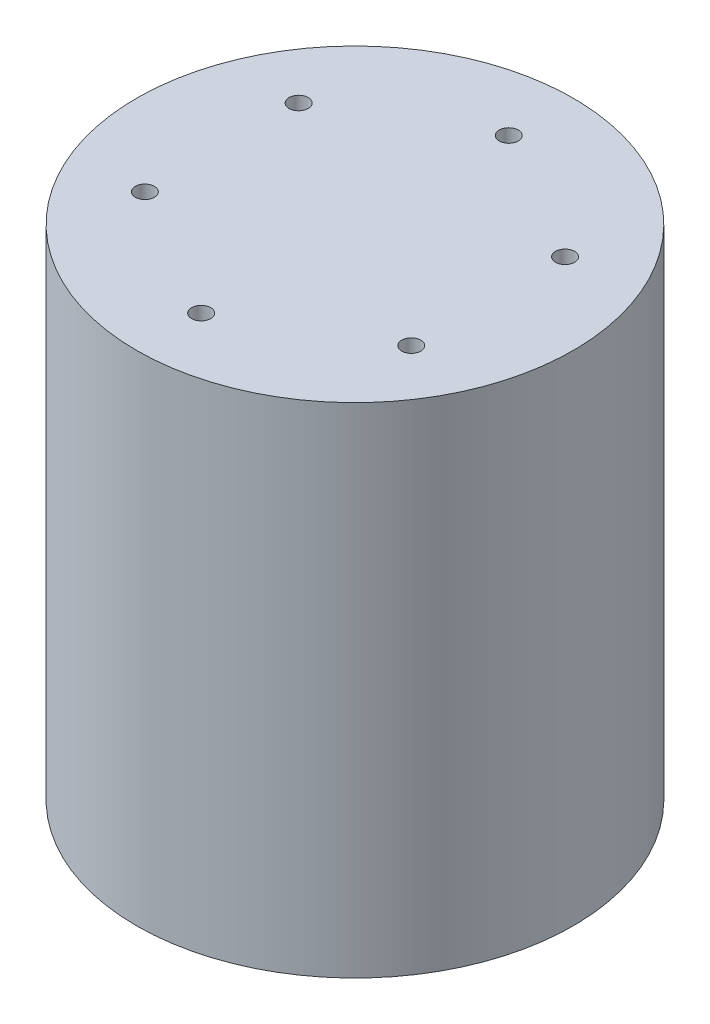
ISO-10303-21;
HEADER;
FILE_DESCRIPTION(('STEP AP214'),'2;1');
FILE_NAME('part.step','',(''),(''),'','','');
FILE_SCHEMA(('AUTOMOTIVE_DESIGN { 1 0 10303 214 1 1 1 1 }'));
ENDSEC;
DATA;
#1=APPLICATION_CONTEXT('core data for automotive mechanical design processes');
#2=APPLICATION_PROTOCOL_DEFINITION('international standard','automotive_design',2000,#1);
#3=PRODUCT_CONTEXT('',#1,'mechanical');
#4=PRODUCT('Part','Part','',(#3));
#5=PRODUCT_RELATED_PRODUCT_CATEGORY('part','',(#4));
#6=PRODUCT_DEFINITION_FORMATION('','',#4);
#7=PRODUCT_DEFINITION_CONTEXT('part definition',#1,'design');
#8=PRODUCT_DEFINITION('design','',#6,#7);
#9=PRODUCT_DEFINITION_SHAPE('','',#8);
#10=(LENGTH_UNIT() NAMED_UNIT(*) SI_UNIT(.MILLI.,.METRE.));
#11=(NAMED_UNIT(*) PLANE_ANGLE_UNIT() SI_UNIT($,.RADIAN.));
#12=(NAMED_UNIT(*) SI_UNIT($,.STERADIAN.) SOLID_ANGLE_UNIT());
#13=UNCERTAINTY_MEASURE_WITH_UNIT(LENGTH_MEASURE(1.E-05),#10,'distance_accuracy_value','');
#14=(GEOMETRIC_REPRESENTATION_CONTEXT(3) GLOBAL_UNCERTAINTY_ASSIGNED_CONTEXT((#13)) GLOBAL_UNIT_ASSIGNED_CONTEXT((#10,
#11,#12)) REPRESENTATION_CONTEXT('',''));
#15=CARTESIAN_POINT('',(0.,0.,0.));
#16=DIRECTION('',(0.,0.,1.));
#17=DIRECTION('',(1.,0.,0.));
#18=AXIS2_PLACEMENT_3D('',#15,#16,#17);
#19=CARTESIAN_POINT('',(0.,81.,0.));
#20=DIRECTION('',(0.,-1.,0.));
#21=DIRECTION('',(0.,0.,-1.));
#22=AXIS2_PLACEMENT_3D('',#19,#20,#21);
#23=CYLINDRICAL_SURFACE('',#22,35.5);
#24=CARTESIAN_POINT('',(0.,81.,0.));
#25=DIRECTION('',(0.,1.,0.));
#26=DIRECTION('',(0.,0.,1.));
#27=AXIS2_PLACEMENT_3D('',#24,#25,#26);
#28=CIRCLE('',#27,35.5);
#29=CARTESIAN_POINT('',(0.,81.,35.5));
#30=VERTEX_POINT('',#29);
#31=EDGE_CURVE('E10',#30,#30,#28,.T.);
#32=ORIENTED_EDGE('',*,*,#31,.F.);
#33=EDGE_LOOP('',(#32));
#34=FACE_BOUND('',#33,.T.);
#35=CARTESIAN_POINT('',(0.,0.,0.));
#36=DIRECTION('',(0.,1.,0.));
#37=DIRECTION('',(0.,0.,1.));
#38=AXIS2_PLACEMENT_3D('',#35,#36,#37);
#39=CIRCLE('',#38,35.5);
#40=CARTESIAN_POINT('',(0.,0.,35.5));
#41=VERTEX_POINT('',#40);
#42=EDGE_CURVE('E34',#41,#41,#39,.T.);
#43=ORIENTED_EDGE('',*,*,#42,.T.);
#44=EDGE_LOOP('',(#43));
#45=FACE_BOUND('',#44,.T.);
#46=ADVANCED_FACE('F31',(#34,#45),#23,.T.);
#47=CARTESIAN_POINT('',(0.,81.,0.));
#48=DIRECTION('',(0.,1.,0.));
#49=DIRECTION('',(0.,0.,1.));
#50=AXIS2_PLACEMENT_3D('',#47,#48,#49);
#51=PLANE('',#50);
#52=CARTESIAN_POINT('',(0.,81.,-25.));
#53=DIRECTION('',(0.,1.,0.));
#54=DIRECTION('',(0.,0.,1.));
#55=AXIS2_PLACEMENT_3D('',#52,#53,#54);
#56=CIRCLE('',#55,1.55);
#57=CARTESIAN_POINT('',(0.,81.,-23.45));
#58=VERTEX_POINT('',#57);
#59=EDGE_CURVE('E110',#58,#58,#56,.T.);
#60=ORIENTED_EDGE('',*,*,#59,.F.);
#61=EDGE_LOOP('',(#60));
#62=FACE_BOUND('',#61,.T.);
#63=CARTESIAN_POINT('',(-21.6506350946105,81.,-12.4999999999992));
#64=DIRECTION('',(0.,1.,0.));
#65=DIRECTION('',(0.,0.,1.));
#66=AXIS2_PLACEMENT_3D('',#63,#64,#65);
#67=CIRCLE('',#66,1.55);
#68=CARTESIAN_POINT('',(-21.6506350946105,81.,-10.9499999999992));
#69=VERTEX_POINT('',#68);
#70=EDGE_CURVE('E111',#69,#69,#67,.T.);
#71=ORIENTED_EDGE('',*,*,#70,.F.);
#72=EDGE_LOOP('',(#71));
#73=FACE_BOUND('',#72,.T.);
#74=CARTESIAN_POINT('',(-21.6506350946096,81.,12.5000000000008));
#75=DIRECTION('',(0.,1.,0.));
#76=DIRECTION('',(0.,0.,1.));
#77=AXIS2_PLACEMENT_3D('',#74,#75,#76);
#78=CIRCLE('',#77,1.55);
#79=CARTESIAN_POINT('',(-21.6506350946096,81.,14.0500000000008));
#80=VERTEX_POINT('',#79);
#81=EDGE_CURVE('E85',#80,#80,#78,.T.);
#82=ORIENTED_EDGE('',*,*,#81,.F.);
#83=EDGE_LOOP('',(#82));
#84=FACE_BOUND('',#83,.T.);
#85=CARTESIAN_POINT('',(1.78116891849515E-12,81.,25.));
#86=DIRECTION('',(0.,1.,0.));
#87=DIRECTION('',(0.,0.,1.));
#88=AXIS2_PLACEMENT_3D('',#85,#86,#87);
#89=CIRCLE('',#88,1.55);
#90=CARTESIAN_POINT('',(1.78116891849515E-12,81.,26.55));
#91=VERTEX_POINT('',#90);
#92=EDGE_CURVE('E92',#91,#91,#89,.T.);
#93=ORIENTED_EDGE('',*,*,#92,.F.);
#94=EDGE_LOOP('',(#93));
#95=FACE_BOUND('',#94,.T.);
#96=CARTESIAN_POINT('',(21.6506350946123,81.,12.4999999999992));
#97=DIRECTION('',(0.,1.,0.));
#98=DIRECTION('',(0.,0.,1.));
#99=AXIS2_PLACEMENT_3D('',#96,#97,#98);
#100=CIRCLE('',#99,1.55);
#101=CARTESIAN_POINT('',(21.6506350946123,81.,14.0499999999992));
#102=VERTEX_POINT('',#101);
#103=EDGE_CURVE('E98',#102,#102,#100,.T.);
#104=ORIENTED_EDGE('',*,*,#103,.F.);
#105=EDGE_LOOP('',(#104));
#106=FACE_BOUND('',#105,.T.);
#107=CARTESIAN_POINT('',(21.6506350946114,81.,-12.5000000000008));
#108=DIRECTION('',(0.,1.,0.));
#109=DIRECTION('',(0.,0.,1.));
#110=AXIS2_PLACEMENT_3D('',#107,#108,#109);
#111=CIRCLE('',#110,1.55);
#112=CARTESIAN_POINT('',(21.6506350946114,81.,-10.9500000000008));
#113=VERTEX_POINT('',#112);
#114=EDGE_CURVE('E104',#113,#113,#111,.T.);
#115=ORIENTED_EDGE('',*,*,#114,.F.);
#116=EDGE_LOOP('',(#115));
#117=FACE_BOUND('',#116,.T.);
#118=ORIENTED_EDGE('',*,*,#31,.T.);
#119=EDGE_LOOP('',(#118));
#120=FACE_BOUND('',#119,.T.);
#121=ADVANCED_FACE('F130',(#62,#73,#84,#95,#106,#117,#120),#51,.T.);
#122=CARTESIAN_POINT('',(0.,0.,0.));
#123=DIRECTION('',(0.,1.,0.));
#124=DIRECTION('',(0.,0.,1.));
#125=AXIS2_PLACEMENT_3D('',#122,#123,#124);
#126=PLANE('',#125);
#127=CARTESIAN_POINT('',(0.,0.,0.));
#128=DIRECTION('',(0.,-1.,0.));
#129=DIRECTION('',(0.,0.,-1.));
#130=AXIS2_PLACEMENT_3D('',#127,#128,#129);
#131=CIRCLE('',#130,26.);
#132=CARTESIAN_POINT('',(0.,0.,-26.));
#133=VERTEX_POINT('',#132);
#134=EDGE_CURVE('E43',#133,#133,#131,.T.);
#135=ORIENTED_EDGE('',*,*,#134,.F.);
#136=EDGE_LOOP('',(#135));
#137=FACE_BOUND('',#136,.T.);
#138=ORIENTED_EDGE('',*,*,#42,.F.);
#139=EDGE_LOOP('',(#138));
#140=FACE_BOUND('',#139,.T.);
#141=ADVANCED_FACE('F133',(#137,#140),#126,.F.);
#142=CARTESIAN_POINT('',(0.,7.,0.));
#143=DIRECTION('',(0.,-1.,0.));
#144=DIRECTION('',(0.,0.,-1.));
#145=AXIS2_PLACEMENT_3D('',#142,#143,#144);
#146=CYLINDRICAL_SURFACE('',#145,26.);
#147=CARTESIAN_POINT('',(0.,7.,0.));
#148=DIRECTION('',(0.,-1.,0.));
#149=DIRECTION('',(0.,0.,-1.));
#150=AXIS2_PLACEMENT_3D('',#147,#148,#149);
#151=CIRCLE('',#150,26.);
#152=CARTESIAN_POINT('',(0.,7.,-26.));
#153=VERTEX_POINT('',#152);
#154=EDGE_CURVE('E41',#153,#153,#151,.T.);
#155=ORIENTED_EDGE('',*,*,#154,.F.);
#156=EDGE_LOOP('',(#155));
#157=FACE_BOUND('',#156,.T.);
#158=ORIENTED_EDGE('',*,*,#134,.T.);
#159=EDGE_LOOP('',(#158));
#160=FACE_BOUND('',#159,.T.);
#161=ADVANCED_FACE('F171',(#157,#160),#146,.F.);
#162=CARTESIAN_POINT('',(0.,7.,0.));
#163=DIRECTION('',(0.,-1.,0.));
#164=DIRECTION('',(0.,0.,-1.));
#165=AXIS2_PLACEMENT_3D('',#162,#163,#164);
#166=PLANE('',#165);
#167=CARTESIAN_POINT('',(0.,7.,0.));
#168=DIRECTION('',(0.,-1.,0.));
#169=DIRECTION('',(0.,0.,-1.));
#170=AXIS2_PLACEMENT_3D('',#167,#168,#169);
#171=CIRCLE('',#170,20.);
#172=CARTESIAN_POINT('',(0.,7.,-20.));
#173=VERTEX_POINT('',#172);
#174=EDGE_CURVE('E46',#173,#173,#171,.T.);
#175=ORIENTED_EDGE('',*,*,#174,.F.);
#176=EDGE_LOOP('',(#175));
#177=FACE_BOUND('',#176,.T.);
#178=ORIENTED_EDGE('',*,*,#154,.T.);
#179=EDGE_LOOP('',(#178));
#180=FACE_BOUND('',#179,.T.);
#181=ADVANCED_FACE('F177',(#177,#180),#166,.T.);
#182=CARTESIAN_POINT('',(0.,7.,0.));
#183=DIRECTION('',(0.,-1.,0.));
#184=DIRECTION('',(0.,0.,-1.));
#185=AXIS2_PLACEMENT_3D('',#182,#183,#184);
#186=CYLINDRICAL_SURFACE('',#185,20.);
#187=ORIENTED_EDGE('',*,*,#174,.T.);
#188=EDGE_LOOP('',(#187));
#189=FACE_BOUND('',#188,.T.);
#190=CARTESIAN_POINT('',(0.,0.,0.));
#191=DIRECTION('',(0.,-1.,0.));
#192=DIRECTION('',(0.,0.,-1.));
#193=AXIS2_PLACEMENT_3D('',#190,#191,#192);
#194=CIRCLE('',#193,20.);
#195=CARTESIAN_POINT('',(0.,0.,-20.));
#196=VERTEX_POINT('',#195);
#197=EDGE_CURVE('E49',#196,#196,#194,.T.);
#198=ORIENTED_EDGE('',*,*,#197,.F.);
#199=EDGE_LOOP('',(#198));
#200=FACE_BOUND('',#199,.T.);
#201=ADVANCED_FACE('F183',(#189,#200),#186,.T.);
#202=CARTESIAN_POINT('',(0.,0.,15.));
#203=DIRECTION('',(0.,-1.,0.));
#204=DIRECTION('',(0.,0.,-1.));
#205=AXIS2_PLACEMENT_3D('',#202,#203,#204);
#206=CIRCLE('',#205,1.6);
#207=CARTESIAN_POINT('',(0.,0.,13.4));
#208=VERTEX_POINT('',#207);
#209=EDGE_CURVE('E80',#208,#208,#206,.T.);
#210=ORIENTED_EDGE('',*,*,#209,.F.);
#211=EDGE_LOOP('',(#210));
#212=FACE_BOUND('',#211,.T.);
#213=CARTESIAN_POINT('',(14.2658477444277,0.,4.63525491562482));
#214=DIRECTION('',(0.,-1.,0.));
#215=DIRECTION('',(0.,0.,-1.));
#216=AXIS2_PLACEMENT_3D('',#213,#214,#215);
#217=CIRCLE('',#216,1.6);
#218=CARTESIAN_POINT('',(14.2658477444277,0.,3.03525491562482));
#219=VERTEX_POINT('',#218);
#220=EDGE_CURVE('E74',#219,#219,#217,.T.);
#221=ORIENTED_EDGE('',*,*,#220,.F.);
#222=EDGE_LOOP('',(#221));
#223=FACE_BOUND('',#222,.T.);
#224=CARTESIAN_POINT('',(8.81677878438825,0.,-12.1352549156238));
#225=DIRECTION('',(0.,-1.,0.));
#226=DIRECTION('',(0.,0.,-1.));
#227=AXIS2_PLACEMENT_3D('',#224,#225,#226);
#228=CIRCLE('',#227,1.6);
#229=CARTESIAN_POINT('',(8.81677878438825,0.,-13.7352549156238));
#230=VERTEX_POINT('',#229);
#231=EDGE_CURVE('E68',#230,#230,#228,.T.);
#232=ORIENTED_EDGE('',*,*,#231,.F.);
#233=EDGE_LOOP('',(#232));
#234=FACE_BOUND('',#233,.T.);
#235=CARTESIAN_POINT('',(-8.81677878438594,0.,-12.1352549156246));
#236=DIRECTION('',(0.,-1.,0.));
#237=DIRECTION('',(0.,0.,-1.));
#238=AXIS2_PLACEMENT_3D('',#235,#236,#237);
#239=CIRCLE('',#238,1.6);
#240=CARTESIAN_POINT('',(-8.81677878438594,0.,-13.7352549156246));
#241=VERTEX_POINT('',#240);
#242=EDGE_CURVE('E62',#241,#241,#239,.T.);
#243=ORIENTED_EDGE('',*,*,#242,.F.);
#244=EDGE_LOOP('',(#243));
#245=FACE_BOUND('',#244,.T.);
#246=CARTESIAN_POINT('',(-14.2658477444269,0.,4.6352549156236));
#247=DIRECTION('',(0.,-1.,0.));
#248=DIRECTION('',(0.,0.,-1.));
#249=AXIS2_PLACEMENT_3D('',#246,#247,#248);
#250=CIRCLE('',#249,1.6);
#251=CARTESIAN_POINT('',(-14.2658477444269,0.,3.0352549156236));
#252=VERTEX_POINT('',#251);
#253=EDGE_CURVE('E55',#252,#252,#250,.T.);
#254=ORIENTED_EDGE('',*,*,#253,.F.);
#255=EDGE_LOOP('',(#254));
#256=FACE_BOUND('',#255,.T.);
#257=ORIENTED_EDGE('',*,*,#197,.T.);
#258=EDGE_LOOP('',(#257));
#259=FACE_BOUND('',#258,.T.);
#260=ADVANCED_FACE('F173',(#212,#223,#234,#245,#256,#259),#126,.F.);
#261=CARTESIAN_POINT('',(-14.2658477444269,7.,4.6352549156236));
#262=DIRECTION('',(0.,-1.,0.));
#263=DIRECTION('',(0.,0.,-1.));
#264=AXIS2_PLACEMENT_3D('',#261,#262,#263);
#265=CYLINDRICAL_SURFACE('',#264,1.6);
#266=CARTESIAN_POINT('',(-14.2658477444269,7.,4.6352549156236));
#267=DIRECTION('',(0.,-1.,0.));
#268=DIRECTION('',(0.,0.,-1.));
#269=AXIS2_PLACEMENT_3D('',#266,#267,#268);
#270=CIRCLE('',#269,1.6);
#271=CARTESIAN_POINT('',(-14.2658477444269,7.,3.0352549156236));
#272=VERTEX_POINT('',#271);
#273=EDGE_CURVE('E58',#272,#272,#270,.T.);
#274=ORIENTED_EDGE('',*,*,#273,.F.);
#275=EDGE_LOOP('',(#274));
#276=FACE_BOUND('',#275,.T.);
#277=ORIENTED_EDGE('',*,*,#253,.T.);
#278=EDGE_LOOP('',(#277));
#279=FACE_BOUND('',#278,.T.);
#280=ADVANCED_FACE('F182',(#276,#279),#265,.F.);
#281=CARTESIAN_POINT('',(-14.2658477444269,7.,4.6352549156236));
#282=DIRECTION('',(0.,-1.,0.));
#283=DIRECTION('',(0.,0.,-1.));
#284=AXIS2_PLACEMENT_3D('',#281,#282,#283);
#285=PLANE('',#284);
#286=ORIENTED_EDGE('',*,*,#273,.T.);
#287=EDGE_LOOP('',(#286));
#288=FACE_BOUND('',#287,.T.);
#289=ADVANCED_FACE('F189',(#288),#285,.T.);
#290=CARTESIAN_POINT('',(-8.81677878438594,7.,-12.1352549156246));
#291=DIRECTION('',(0.,-1.,0.));
#292=DIRECTION('',(0.,0.,-1.));
#293=AXIS2_PLACEMENT_3D('',#290,#291,#292);
#294=CYLINDRICAL_SURFACE('',#293,1.6);
#295=CARTESIAN_POINT('',(-8.81677878438594,7.,-12.1352549156246));
#296=DIRECTION('',(0.,-1.,0.));
#297=DIRECTION('',(0.,0.,-1.));
#298=AXIS2_PLACEMENT_3D('',#295,#296,#297);
#299=CIRCLE('',#298,1.6);
#300=CARTESIAN_POINT('',(-8.81677878438594,7.,-13.7352549156246));
#301=VERTEX_POINT('',#300);
#302=EDGE_CURVE('E65',#301,#301,#299,.T.);
#303=ORIENTED_EDGE('',*,*,#302,.F.);
#304=EDGE_LOOP('',(#303));
#305=FACE_BOUND('',#304,.T.);
#306=ORIENTED_EDGE('',*,*,#242,.T.);
#307=EDGE_LOOP('',(#306));
#308=FACE_BOUND('',#307,.T.);
#309=ADVANCED_FACE('F208',(#305,#308),#294,.F.);
#310=CARTESIAN_POINT('',(-8.81677878438594,7.,-12.1352549156246));
#311=DIRECTION('',(0.,-1.,0.));
#312=DIRECTION('',(0.,0.,-1.));
#313=AXIS2_PLACEMENT_3D('',#310,#311,#312);
#314=PLANE('',#313);
#315=ORIENTED_EDGE('',*,*,#302,.T.);
#316=EDGE_LOOP('',(#315));
#317=FACE_BOUND('',#316,.T.);
#318=ADVANCED_FACE('F210',(#317),#314,.T.);
#319=CARTESIAN_POINT('',(8.81677878438825,7.,-12.1352549156238));
#320=DIRECTION('',(0.,-1.,0.));
#321=DIRECTION('',(0.,0.,-1.));
#322=AXIS2_PLACEMENT_3D('',#319,#320,#321);
#323=CYLINDRICAL_SURFACE('',#322,1.6);
#324=CARTESIAN_POINT('',(8.81677878438825,7.,-12.1352549156238));
#325=DIRECTION('',(0.,-1.,0.));
#326=DIRECTION('',(0.,0.,-1.));
#327=AXIS2_PLACEMENT_3D('',#324,#325,#326);
#328=CIRCLE('',#327,1.6);
#329=CARTESIAN_POINT('',(8.81677878438825,7.,-13.7352549156238));
#330=VERTEX_POINT('',#329);
#331=EDGE_CURVE('E71',#330,#330,#328,.T.);
#332=ORIENTED_EDGE('',*,*,#331,.F.);
#333=EDGE_LOOP('',(#332));
#334=FACE_BOUND('',#333,.T.);
#335=ORIENTED_EDGE('',*,*,#231,.T.);
#336=EDGE_LOOP('',(#335));
#337=FACE_BOUND('',#336,.T.);
#338=ADVANCED_FACE('F217',(#334,#337),#323,.F.);
#339=CARTESIAN_POINT('',(8.81677878438825,7.,-12.1352549156238));
#340=DIRECTION('',(0.,-1.,0.));
#341=DIRECTION('',(0.,0.,-1.));
#342=AXIS2_PLACEMENT_3D('',#339,#340,#341);
#343=PLANE('',#342);
#344=ORIENTED_EDGE('',*,*,#331,.T.);
#345=EDGE_LOOP('',(#344));
#346=FACE_BOUND('',#345,.T.);
#347=ADVANCED_FACE('F276',(#346),#343,.T.);
#348=CARTESIAN_POINT('',(14.2658477444277,7.,4.63525491562482));
#349=DIRECTION('',(0.,-1.,0.));
#350=DIRECTION('',(0.,0.,-1.));
#351=AXIS2_PLACEMENT_3D('',#348,#349,#350);
#352=CYLINDRICAL_SURFACE('',#351,1.6);
#353=CARTESIAN_POINT('',(14.2658477444277,7.,4.63525491562482));
#354=DIRECTION('',(0.,-1.,0.));
#355=DIRECTION('',(0.,0.,-1.));
#356=AXIS2_PLACEMENT_3D('',#353,#354,#355);
#357=CIRCLE('',#356,1.6);
#358=CARTESIAN_POINT('',(14.2658477444277,7.,3.03525491562482));
#359=VERTEX_POINT('',#358);
#360=EDGE_CURVE('E77',#359,#359,#357,.T.);
#361=ORIENTED_EDGE('',*,*,#360,.F.);
#362=EDGE_LOOP('',(#361));
#363=FACE_BOUND('',#362,.T.);
#364=ORIENTED_EDGE('',*,*,#220,.T.);
#365=EDGE_LOOP('',(#364));
#366=FACE_BOUND('',#365,.T.);
#367=ADVANCED_FACE('F285',(#363,#366),#352,.F.);
#368=CARTESIAN_POINT('',(14.2658477444277,7.,4.63525491562482));
#369=DIRECTION('',(0.,-1.,0.));
#370=DIRECTION('',(0.,0.,-1.));
#371=AXIS2_PLACEMENT_3D('',#368,#369,#370);
#372=PLANE('',#371);
#373=ORIENTED_EDGE('',*,*,#360,.T.);
#374=EDGE_LOOP('',(#373));
#375=FACE_BOUND('',#374,.T.);
#376=ADVANCED_FACE('F295',(#375),#372,.T.);
#377=CARTESIAN_POINT('',(0.,7.,15.));
#378=DIRECTION('',(0.,-1.,0.));
#379=DIRECTION('',(0.,0.,-1.));
#380=AXIS2_PLACEMENT_3D('',#377,#378,#379);
#381=CYLINDRICAL_SURFACE('',#380,1.6);
#382=CARTESIAN_POINT('',(0.,7.,15.));
#383=DIRECTION('',(0.,-1.,0.));
#384=DIRECTION('',(0.,0.,-1.));
#385=AXIS2_PLACEMENT_3D('',#382,#383,#384);
#386=CIRCLE('',#385,1.6);
#387=CARTESIAN_POINT('',(0.,7.,13.4));
#388=VERTEX_POINT('',#387);
#389=EDGE_CURVE('E52',#388,#388,#386,.T.);
#390=ORIENTED_EDGE('',*,*,#389,.F.);
#391=EDGE_LOOP('',(#390));
#392=FACE_BOUND('',#391,.T.);
#393=ORIENTED_EDGE('',*,*,#209,.T.);
#394=EDGE_LOOP('',(#393));
#395=FACE_BOUND('',#394,.T.);
#396=ADVANCED_FACE('F158',(#392,#395),#381,.F.);
#397=CARTESIAN_POINT('',(0.,7.,15.));
#398=DIRECTION('',(0.,-1.,0.));
#399=DIRECTION('',(0.,0.,-1.));
#400=AXIS2_PLACEMENT_3D('',#397,#398,#399);
#401=PLANE('',#400);
#402=ORIENTED_EDGE('',*,*,#389,.T.);
#403=EDGE_LOOP('',(#402));
#404=FACE_BOUND('',#403,.T.);
#405=ADVANCED_FACE('F148',(#404),#401,.T.);
#406=CARTESIAN_POINT('',(21.6506350946114,74.,-12.5000000000008));
#407=DIRECTION('',(0.,1.,0.));
#408=DIRECTION('',(0.,0.,1.));
#409=AXIS2_PLACEMENT_3D('',#406,#407,#408);
#410=CYLINDRICAL_SURFACE('',#409,1.55);
#411=CARTESIAN_POINT('',(21.6506350946114,74.,-12.5000000000008));
#412=DIRECTION('',(0.,1.,0.));
#413=DIRECTION('',(0.,0.,1.));
#414=AXIS2_PLACEMENT_3D('',#411,#412,#413);
#415=CIRCLE('',#414,1.55);
#416=CARTESIAN_POINT('',(21.6506350946114,74.,-10.9500000000008));
#417=VERTEX_POINT('',#416);
#418=EDGE_CURVE('E107',#417,#417,#415,.T.);
#419=ORIENTED_EDGE('',*,*,#418,.F.);
#420=EDGE_LOOP('',(#419));
#421=FACE_BOUND('',#420,.T.);
#422=ORIENTED_EDGE('',*,*,#114,.T.);
#423=EDGE_LOOP('',(#422));
#424=FACE_BOUND('',#423,.T.);
#425=ADVANCED_FACE('F145',(#421,#424),#410,.F.);
#426=CARTESIAN_POINT('',(21.6506350946114,74.,-12.5000000000008));
#427=DIRECTION('',(0.,1.,0.));
#428=DIRECTION('',(0.,0.,1.));
#429=AXIS2_PLACEMENT_3D('',#426,#427,#428);
#430=PLANE('',#429);
#431=ORIENTED_EDGE('',*,*,#418,.T.);
#432=EDGE_LOOP('',(#431));
#433=FACE_BOUND('',#432,.T.);
#434=ADVANCED_FACE('F147',(#433),#430,.T.);
#435=CARTESIAN_POINT('',(21.6506350946123,74.,12.4999999999992));
#436=DIRECTION('',(0.,1.,0.));
#437=DIRECTION('',(0.,0.,1.));
#438=AXIS2_PLACEMENT_3D('',#435,#436,#437);
#439=CYLINDRICAL_SURFACE('',#438,1.55);
#440=CARTESIAN_POINT('',(21.6506350946123,74.,12.4999999999992));
#441=DIRECTION('',(0.,1.,0.));
#442=DIRECTION('',(0.,0.,1.));
#443=AXIS2_PLACEMENT_3D('',#440,#441,#442);
#444=CIRCLE('',#443,1.55);
#445=CARTESIAN_POINT('',(21.6506350946123,74.,14.0499999999992));
#446=VERTEX_POINT('',#445);
#447=EDGE_CURVE('E101',#446,#446,#444,.T.);
#448=ORIENTED_EDGE('',*,*,#447,.F.);
#449=EDGE_LOOP('',(#448));
#450=FACE_BOUND('',#449,.T.);
#451=ORIENTED_EDGE('',*,*,#103,.T.);
#452=EDGE_LOOP('',(#451));
#453=FACE_BOUND('',#452,.T.);
#454=ADVANCED_FACE('F155',(#450,#453),#439,.F.);
#455=CARTESIAN_POINT('',(21.6506350946123,74.,12.4999999999992));
#456=DIRECTION('',(0.,1.,0.));
#457=DIRECTION('',(0.,0.,1.));
#458=AXIS2_PLACEMENT_3D('',#455,#456,#457);
#459=PLANE('',#458);
#460=ORIENTED_EDGE('',*,*,#447,.T.);
#461=EDGE_LOOP('',(#460));
#462=FACE_BOUND('',#461,.T.);
#463=ADVANCED_FACE('F346',(#462),#459,.T.);
#464=CARTESIAN_POINT('',(1.78116891849515E-12,74.,25.));
#465=DIRECTION('',(0.,1.,0.));
#466=DIRECTION('',(0.,0.,1.));
#467=AXIS2_PLACEMENT_3D('',#464,#465,#466);
#468=CYLINDRICAL_SURFACE('',#467,1.55);
#469=CARTESIAN_POINT('',(1.78116891849515E-12,74.,25.));
#470=DIRECTION('',(0.,1.,0.));
#471=DIRECTION('',(0.,0.,1.));
#472=AXIS2_PLACEMENT_3D('',#469,#470,#471);
#473=CIRCLE('',#472,1.55);
#474=CARTESIAN_POINT('',(1.78116891849515E-12,74.,26.55));
#475=VERTEX_POINT('',#474);
#476=EDGE_CURVE('E95',#475,#475,#473,.T.);
#477=ORIENTED_EDGE('',*,*,#476,.F.);
#478=EDGE_LOOP('',(#477));
#479=FACE_BOUND('',#478,.T.);
#480=ORIENTED_EDGE('',*,*,#92,.T.);
#481=EDGE_LOOP('',(#480));
#482=FACE_BOUND('',#481,.T.);
#483=ADVANCED_FACE('F356',(#479,#482),#468,.F.);
#484=CARTESIAN_POINT('',(1.78116891849515E-12,74.,25.));
#485=DIRECTION('',(0.,1.,0.));
#486=DIRECTION('',(0.,0.,1.));
#487=AXIS2_PLACEMENT_3D('',#484,#485,#486);
#488=PLANE('',#487);
#489=ORIENTED_EDGE('',*,*,#476,.T.);
#490=EDGE_LOOP('',(#489));
#491=FACE_BOUND('',#490,.T.);
#492=ADVANCED_FACE('F365',(#491),#488,.T.);
#493=CARTESIAN_POINT('',(-21.6506350946096,74.,12.5000000000008));
#494=DIRECTION('',(0.,1.,0.));
#495=DIRECTION('',(0.,0.,1.));
#496=AXIS2_PLACEMENT_3D('',#493,#494,#495);
#497=CYLINDRICAL_SURFACE('',#496,1.55);
#498=CARTESIAN_POINT('',(-21.6506350946096,74.,12.5000000000008));
#499=DIRECTION('',(0.,1.,0.));
#500=DIRECTION('',(0.,0.,1.));
#501=AXIS2_PLACEMENT_3D('',#498,#499,#500);
#502=CIRCLE('',#501,1.55);
#503=CARTESIAN_POINT('',(-21.6506350946096,74.,14.0500000000008));
#504=VERTEX_POINT('',#503);
#505=EDGE_CURVE('E88',#504,#504,#502,.T.);
#506=ORIENTED_EDGE('',*,*,#505,.F.);
#507=EDGE_LOOP('',(#506));
#508=FACE_BOUND('',#507,.T.);
#509=ORIENTED_EDGE('',*,*,#81,.T.);
#510=EDGE_LOOP('',(#509));
#511=FACE_BOUND('',#510,.T.);
#512=ADVANCED_FACE('F375',(#508,#511),#497,.F.);
#513=CARTESIAN_POINT('',(-21.6506350946096,74.,12.5000000000008));
#514=DIRECTION('',(0.,1.,0.));
#515=DIRECTION('',(0.,0.,1.));
#516=AXIS2_PLACEMENT_3D('',#513,#514,#515);
#517=PLANE('',#516);
#518=ORIENTED_EDGE('',*,*,#505,.T.);
#519=EDGE_LOOP('',(#518));
#520=FACE_BOUND('',#519,.T.);
#521=ADVANCED_FACE('F385',(#520),#517,.T.);
#522=CARTESIAN_POINT('',(-21.6506350946105,74.,-12.4999999999992));
#523=DIRECTION('',(0.,1.,0.));
#524=DIRECTION('',(0.,0.,1.));
#525=AXIS2_PLACEMENT_3D('',#522,#523,#524);
#526=CYLINDRICAL_SURFACE('',#525,1.55);
#527=CARTESIAN_POINT('',(-21.6506350946105,74.,-12.4999999999992));
#528=DIRECTION('',(0.,1.,0.));
#529=DIRECTION('',(0.,0.,1.));
#530=AXIS2_PLACEMENT_3D('',#527,#528,#529);
#531=CIRCLE('',#530,1.55);
#532=CARTESIAN_POINT('',(-21.6506350946105,74.,-10.9499999999992));
#533=VERTEX_POINT('',#532);
#534=EDGE_CURVE('E89',#533,#533,#531,.T.);
#535=ORIENTED_EDGE('',*,*,#534,.F.);
#536=EDGE_LOOP('',(#535));
#537=FACE_BOUND('',#536,.T.);
#538=ORIENTED_EDGE('',*,*,#70,.T.);
#539=EDGE_LOOP('',(#538));
#540=FACE_BOUND('',#539,.T.);
#541=ADVANCED_FACE('F395',(#537,#540),#526,.F.);
#542=CARTESIAN_POINT('',(-21.6506350946105,74.,-12.4999999999992));
#543=DIRECTION('',(0.,1.,0.));
#544=DIRECTION('',(0.,0.,1.));
#545=AXIS2_PLACEMENT_3D('',#542,#543,#544);
#546=PLANE('',#545);
#547=ORIENTED_EDGE('',*,*,#534,.T.);
#548=EDGE_LOOP('',(#547));
#549=FACE_BOUND('',#548,.T.);
#550=ADVANCED_FACE('F126',(#549),#546,.T.);
#551=CARTESIAN_POINT('',(0.,74.,-25.));
#552=DIRECTION('',(0.,1.,0.));
#553=DIRECTION('',(0.,0.,1.));
#554=AXIS2_PLACEMENT_3D('',#551,#552,#553);
#555=CYLINDRICAL_SURFACE('',#554,1.55);
#556=CARTESIAN_POINT('',(0.,74.,-25.));
#557=DIRECTION('',(0.,1.,0.));
#558=DIRECTION('',(0.,0.,1.));
#559=AXIS2_PLACEMENT_3D('',#556,#557,#558);
#560=CIRCLE('',#559,1.55);
#561=CARTESIAN_POINT('',(0.,74.,-23.45));
#562=VERTEX_POINT('',#561);
#563=EDGE_CURVE('E59',#562,#562,#560,.T.);
#564=ORIENTED_EDGE('',*,*,#563,.F.);
#565=EDGE_LOOP('',(#564));
#566=FACE_BOUND('',#565,.T.);
#567=ORIENTED_EDGE('',*,*,#59,.T.);
#568=EDGE_LOOP('',(#567));
#569=FACE_BOUND('',#568,.T.);
#570=ADVANCED_FACE('F123',(#566,#569),#555,.F.);
#571=CARTESIAN_POINT('',(0.,74.,-25.));
#572=DIRECTION('',(0.,1.,0.));
#573=DIRECTION('',(0.,0.,1.));
#574=AXIS2_PLACEMENT_3D('',#571,#572,#573);
#575=PLANE('',#574);
#576=ORIENTED_EDGE('',*,*,#563,.T.);
#577=EDGE_LOOP('',(#576));
#578=FACE_BOUND('',#577,.T.);
#579=ADVANCED_FACE('F121',(#578),#575,.T.);
#580=CLOSED_SHELL('',(#46,#121,#141,#161,#181,#201,#260,#280,#289,#309,#318,#338,#347,#367,#376,
#396,#405,#425,#434,#454,#463,#483,#492,#512,#521,#541,#550,#570,#579));
#581=MANIFOLD_SOLID_BREP('B2',#580);
#582=ADVANCED_BREP_SHAPE_REPRESENTATION('',(#18,#581),#14);
#583=SHAPE_DEFINITION_REPRESENTATION(#9,#582);
ENDSEC;
END-ISO-10303-21;
